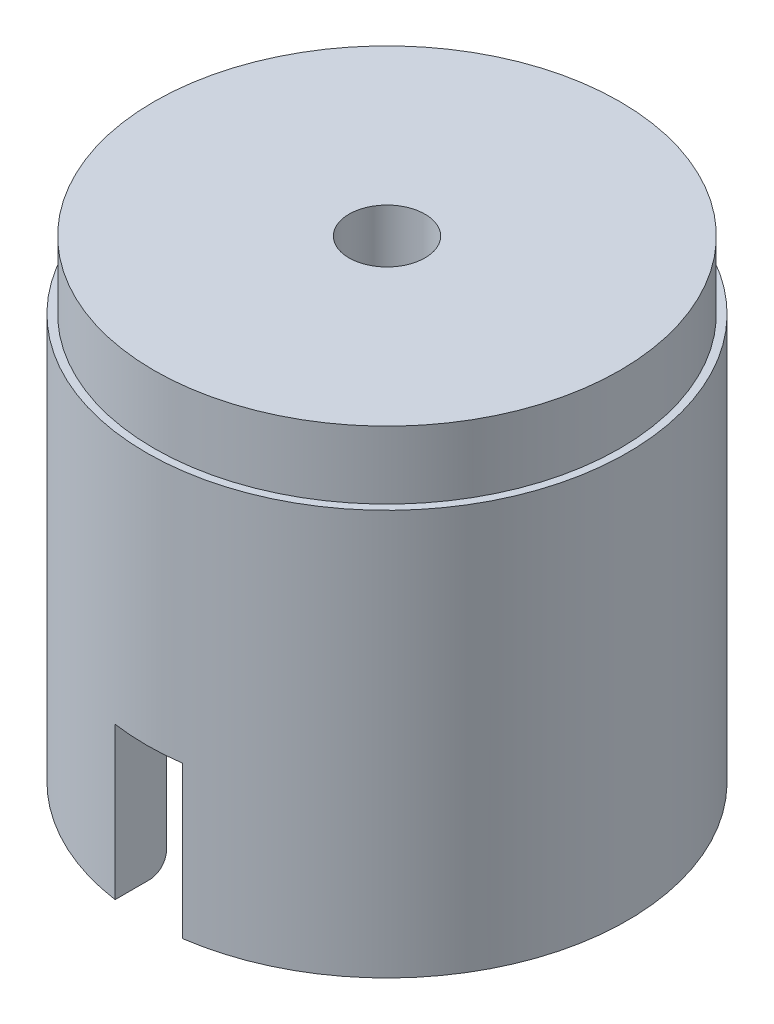
ISO-10303-21;
HEADER;
FILE_DESCRIPTION(('STEP AP214'),'2;1');
FILE_NAME('part.step','',(''),(''),'','','');
FILE_SCHEMA(('AUTOMOTIVE_DESIGN { 1 0 10303 214 1 1 1 1 }'));
ENDSEC;
DATA;
#1=APPLICATION_CONTEXT('core data for automotive mechanical design processes');
#2=APPLICATION_PROTOCOL_DEFINITION('international standard','automotive_design',2000,#1);
#3=PRODUCT_CONTEXT('',#1,'mechanical');
#4=PRODUCT('Part','Part','',(#3));
#5=PRODUCT_RELATED_PRODUCT_CATEGORY('part','',(#4));
#6=PRODUCT_DEFINITION_FORMATION('','',#4);
#7=PRODUCT_DEFINITION_CONTEXT('part definition',#1,'design');
#8=PRODUCT_DEFINITION('design','',#6,#7);
#9=PRODUCT_DEFINITION_SHAPE('','',#8);
#10=(LENGTH_UNIT() NAMED_UNIT(*) SI_UNIT(.MILLI.,.METRE.));
#11=(NAMED_UNIT(*) PLANE_ANGLE_UNIT() SI_UNIT($,.RADIAN.));
#12=(NAMED_UNIT(*) SI_UNIT($,.STERADIAN.) SOLID_ANGLE_UNIT());
#13=UNCERTAINTY_MEASURE_WITH_UNIT(LENGTH_MEASURE(1.E-05),#10,'distance_accuracy_value','');
#14=(GEOMETRIC_REPRESENTATION_CONTEXT(3) GLOBAL_UNCERTAINTY_ASSIGNED_CONTEXT((#13)) GLOBAL_UNIT_ASSIGNED_CONTEXT((#10,
#11,#12)) REPRESENTATION_CONTEXT('',''));
#15=CARTESIAN_POINT('',(0.,0.,0.));
#16=DIRECTION('',(0.,0.,1.));
#17=DIRECTION('',(1.,0.,0.));
#18=AXIS2_PLACEMENT_3D('',#15,#16,#17);
#19=CARTESIAN_POINT('',(0.,0.,0.));
#20=DIRECTION('',(0.,1.,0.));
#21=DIRECTION('',(0.,0.,1.));
#22=AXIS2_PLACEMENT_3D('',#19,#20,#21);
#23=PLANE('',#22);
#24=CARTESIAN_POINT('',(0.,0.,0.));
#25=DIRECTION('',(0.,1.,0.));
#26=DIRECTION('',(0.,0.,1.));
#27=AXIS2_PLACEMENT_3D('',#24,#25,#26);
#28=CIRCLE('',#27,14.25);
#29=CARTESIAN_POINT('',(-2.,0.,-14.1089510595225));
#30=VERTEX_POINT('',#29);
#31=CARTESIAN_POINT('',(-2.,0.,14.1089510595225));
#32=VERTEX_POINT('',#31);
#33=EDGE_CURVE('E198',#30,#32,#28,.T.);
#34=ORIENTED_EDGE('',*,*,#33,.F.);
#35=DIRECTION('',(0.,0.,-1.));
#36=VECTOR('',#35,1.);
#37=CARTESIAN_POINT('',(-2.,0.,14.25));
#38=LINE('',#37,#36);
#39=CARTESIAN_POINT('',(-2.,0.,-12.0856319652694));
#40=VERTEX_POINT('',#39);
#41=EDGE_CURVE('E270',#40,#30,#38,.T.);
#42=ORIENTED_EDGE('',*,*,#41,.F.);
#43=CARTESIAN_POINT('',(0.,0.,0.));
#44=DIRECTION('',(0.,1.,0.));
#45=DIRECTION('',(0.,0.,1.));
#46=AXIS2_PLACEMENT_3D('',#43,#44,#45);
#47=CIRCLE('',#46,12.25);
#48=CARTESIAN_POINT('',(-2.,0.,12.0856319652719));
#49=VERTEX_POINT('',#48);
#50=EDGE_CURVE('E193',#40,#49,#47,.T.);
#51=ORIENTED_EDGE('',*,*,#50,.T.);
#52=EDGE_CURVE('E272',#32,#49,#38,.T.);
#53=ORIENTED_EDGE('',*,*,#52,.F.);
#54=EDGE_LOOP('',(#34,#42,#51,#53));
#55=FACE_BOUND('',#54,.T.);
#56=ADVANCED_FACE('F46',(#55),#23,.F.);
#57=CARTESIAN_POINT('',(0.,1.,0.));
#58=DIRECTION('',(0.,1.,0.));
#59=DIRECTION('',(0.,0.,1.));
#60=AXIS2_PLACEMENT_3D('',#57,#58,#59);
#61=TOROIDAL_SURFACE('',#60,12.25,1.);
#62=CARTESIAN_POINT('',(-2.,0.0384396960274335,-11.8072161191829));
#63=CARTESIAN_POINT('',(-2.,0.022813902189131,-11.862722440152));
#64=CARTESIAN_POINT('',(-2.,0.0118654900201605,-11.9195905242867));
#65=CARTESIAN_POINT('',(-2.,-0.000348546361597228,-12.0344074015084));
#66=CARTESIAN_POINT('',(-2.,-0.0016018466109054,-12.0923574762567));
#67=CARTESIAN_POINT('',(-2.,0.00563845453101223,-12.2076291474685));
#68=CARTESIAN_POINT('',(-2.,0.014128171460806,-12.2649509852089));
#69=CARTESIAN_POINT('',(-2.,0.0406353575985942,-12.3773317849771));
#70=CARTESIAN_POINT('',(-2.,0.0586501707015698,-12.4323913732301));
#71=CARTESIAN_POINT('',(-2.,0.103671550715942,-12.5385297701235));
#72=CARTESIAN_POINT('',(-2.,0.13065368842611,-12.5896189336452));
#73=CARTESIAN_POINT('',(-2.,0.192896248662006,-12.6864827230442));
#74=CARTESIAN_POINT('',(-2.,0.228156655103102,-12.7322573592473));
#75=CARTESIAN_POINT('',(-2.,0.305583499600001,-12.8166911902762));
#76=CARTESIAN_POINT('',(-2.,0.34767709662368,-12.8554171694217));
#77=CARTESIAN_POINT('',(-2.,0.437836224537872,-12.9251487865481));
#78=CARTESIAN_POINT('',(-2.,0.485901337534769,-12.9561549643139));
#79=CARTESIAN_POINT('',(-2.,0.586019647163424,-13.0091776446524));
#80=CARTESIAN_POINT('',(-2.,0.63801819321998,-13.0312973534139));
#81=CARTESIAN_POINT('',(-2.,0.745012567448497,-13.0664003105432));
#82=CARTESIAN_POINT('',(-2.,0.800008217450895,-13.0793841013792));
#83=CARTESIAN_POINT('',(-2.,0.910890028622209,-13.095740844247));
#84=CARTESIAN_POINT('',(-2.,0.9667632726275,-13.0992014596816));
#85=CARTESIAN_POINT('',(-2.,1.07829311322068,-13.0966588680863));
#86=CARTESIAN_POINT('',(-2.,1.13394971572339,-13.090655921276));
#87=CARTESIAN_POINT('',(-2.,1.24327669025393,-13.0694041558035));
#88=CARTESIAN_POINT('',(-2.,1.29695299557747,-13.0541858269402));
#89=CARTESIAN_POINT('',(-2.,1.40100238285518,-13.0149856116269));
#90=CARTESIAN_POINT('',(-2.,1.45137543842847,-12.9910036551976));
#91=CARTESIAN_POINT('',(-2.,1.54759784221479,-12.934882419652));
#92=CARTESIAN_POINT('',(-2.,1.59342992901935,-12.9027135572724));
#93=CARTESIAN_POINT('',(-2.,1.67910629559831,-12.8312040702829));
#94=CARTESIAN_POINT('',(-2.,1.71895032566519,-12.7918631467426));
#95=CARTESIAN_POINT('',(-2.,1.79192692496902,-12.7067399127893));
#96=CARTESIAN_POINT('',(-2.,1.82499309922724,-12.6609006926318));
#97=CARTESIAN_POINT('',(-2.,1.88306622402572,-12.5643746505511));
#98=CARTESIAN_POINT('',(-2.,1.90807267951866,-12.513687531106));
#99=CARTESIAN_POINT('',(-2.,1.94962875096384,-12.4082601517914));
#100=CARTESIAN_POINT('',(-2.,1.96607434631554,-12.3534788867324));
#101=CARTESIAN_POINT('',(-2.,1.98963605794466,-12.2419452998302));
#102=CARTESIAN_POINT('',(-2.,1.99675160721992,-12.1851928584106));
#103=CARTESIAN_POINT('',(-2.,2.00150366086912,-12.0707266688981));
#104=CARTESIAN_POINT('',(-2.,1.99904538764813,-12.0130089702222));
#105=CARTESIAN_POINT('',(-2.,1.98451062797593,-11.8987960990058));
#106=CARTESIAN_POINT('',(-2.,1.97243381224492,-11.8423009683866));
#107=CARTESIAN_POINT('',(-2.,1.93892662494283,-11.73194007359));
#108=CARTESIAN_POINT('',(-2.,1.91746408482456,-11.6780840670108));
#109=CARTESIAN_POINT('',(-2.,1.86575328516538,-11.5747668186685));
#110=CARTESIAN_POINT('',(-2.,1.8355051580229,-11.5253055106921));
#111=CARTESIAN_POINT('',(-2.,1.76723661992728,-11.432498694411));
#112=CARTESIAN_POINT('',(-2.,1.72926067906094,-11.3891204909866));
#113=CARTESIAN_POINT('',(-2.,1.64647806085301,-11.3094601110091));
#114=CARTESIAN_POINT('',(-2.,1.60167186221755,-11.2731774375647));
#115=CARTESIAN_POINT('',(-2.,1.5071255629736,-11.2092588745965));
#116=CARTESIAN_POINT('',(-2.,1.45745818616432,-11.181515434431));
#117=CARTESIAN_POINT('',(-2.,1.35411958708503,-11.1349043382681));
#118=CARTESIAN_POINT('',(-2.,1.30044872004264,-11.1160358958795));
#119=CARTESIAN_POINT('',(-2.,1.19147340161584,-11.0879861075713));
#120=CARTESIAN_POINT('',(-2.,1.1362044493589,-11.0786667581658));
#121=CARTESIAN_POINT('',(-2.,1.02488765187091,-11.0695264471786));
#122=CARTESIAN_POINT('',(-2.,0.968839851735535,-11.0697049379391));
#123=CARTESIAN_POINT('',(-2.,0.858052287865155,-11.0795119543212));
#124=CARTESIAN_POINT('',(-2.,0.803305507255658,-11.089061494509));
#125=CARTESIAN_POINT('',(-2.,0.696188799226591,-11.117194457945));
#126=CARTESIAN_POINT('',(-2.,0.64381877542576,-11.1357775145113));
#127=CARTESIAN_POINT('',(-2.,0.542788548610156,-11.1814619825034));
#128=CARTESIAN_POINT('',(-2.,0.494137522362797,-11.208583670388));
#129=CARTESIAN_POINT('',(-2.,0.401995967697724,-11.2705272149602));
#130=CARTESIAN_POINT('',(-2.,0.358506999206741,-11.305351390212));
#131=CARTESIAN_POINT('',(-2.,0.277361685366345,-11.3821479417218));
#132=CARTESIAN_POINT('',(-2.,0.239783737590362,-11.4242030423531));
#133=CARTESIAN_POINT('',(-2.,0.172134618718201,-11.5139154882057));
#134=CARTESIAN_POINT('',(-2.,0.142055183021836,-11.5615665797085));
#135=CARTESIAN_POINT('',(-2.,0.0998326336670687,-11.6425314478517));
#136=CARTESIAN_POINT('',(-2.,0.0851837055283847,-11.6745656947791));
#137=CARTESIAN_POINT('',(-2.,0.0592556312645726,-11.7399695771181));
#138=CARTESIAN_POINT('',(-2.,0.047976509156312,-11.7733392220452));
#139=CARTESIAN_POINT('',(-2.,0.0384396960274335,-11.8072161191829));
#140=B_SPLINE_CURVE_WITH_KNOTS('',3,(#62,#63,#64,#65,#66,#67,#68,#69,#70,#71,#72,#73,#74,#75,
#76,#77,#78,#79,#80,#81,#82,#83,#84,#85,#86,#87,#88,#89,#90,#91,#92,#93,#94,#95,#96,#97,#98,#99,
#100,#101,#102,#103,#104,#105,#106,#107,#108,#109,#110,#111,#112,#113,#114,#115,#116,#117,#118,
#119,#120,#121,#122,#123,#124,#125,#126,#127,#128,#129,#130,#131,#132,#133,#134,#135,#136,#137,
#138,#139),.UNSPECIFIED.,.T.,.F.,(4,2,2,2,2,2,2,2,2,2,2,2,2,2,2,2,2,2,2,2,2,2,2,2,2,2,2,2,2,2,2,
2,2,2,2,2,2,2,4),(0.,0.172863079628368,0.34594585850197,0.518959654650472,0.691925230746272,
0.864423416560157,1.03692126721373,1.20768836840343,1.37844352583767,1.54715386679004,
1.71585418929524,1.88299630091201,2.05013381670067,2.21672134378787,2.38331020113786,
2.55050979045926,2.7177163502251,2.88648986880407,3.05527375188384,3.2260632364578,
3.39686309970715,3.56935810104716,3.74185900780981,3.91495583399177,4.08805005174747,
4.2601750119623,4.43228791415187,4.6021348572586,4.77196674781891,4.93930805174438,
5.1066397065651,5.27257298797644,5.43849953450657,5.6048231127625,5.77119682521145,
5.93961878685994,6.1078542906895,6.21335620344265,6.31885886809814),.UNSPECIFIED.);
#141=CARTESIAN_POINT('',(-2.,0.999999999999951,-11.0707949127414));
#142=VERTEX_POINT('',#141);
#143=EDGE_CURVE('E242',#142,#40,#140,.T.);
#144=ORIENTED_EDGE('',*,*,#143,.F.);
#145=CARTESIAN_POINT('',(0.,1.,0.));
#146=DIRECTION('',(0.,1.,0.));
#147=DIRECTION('',(0.,0.,1.));
#148=AXIS2_PLACEMENT_3D('',#145,#146,#147);
#149=CIRCLE('',#148,11.25);
#150=CARTESIAN_POINT('',(-2.,1.,11.0707949127423));
#151=VERTEX_POINT('',#150);
#152=EDGE_CURVE('E209',#151,#142,#149,.F.);
#153=ORIENTED_EDGE('',*,*,#152,.F.);
#154=CARTESIAN_POINT('',(-2.,0.390919972436644,11.2809732147051));
#155=CARTESIAN_POINT('',(-2.,0.434882943124424,11.2466876205336));
#156=CARTESIAN_POINT('',(-2.,0.481740871031031,11.2160540659421));
#157=CARTESIAN_POINT('',(-2.,0.579960841677936,11.163041962462));
#158=CARTESIAN_POINT('',(-2.,0.631327446024756,11.1406718960415));
#159=CARTESIAN_POINT('',(-2.,0.737103729610829,11.1049048777515));
#160=CARTESIAN_POINT('',(-2.,0.791513469468614,11.0915081046969));
#161=CARTESIAN_POINT('',(-2.,0.901802836525828,11.0741177893587));
#162=CARTESIAN_POINT('',(-2.,0.957682108760408,11.070121996989));
#163=CARTESIAN_POINT('',(-2.,1.06891929819895,11.0716475704558));
#164=CARTESIAN_POINT('',(-2.,1.12427813336345,11.0771027511032));
#165=CARTESIAN_POINT('',(-2.,1.23329339937328,11.0972318713758));
#166=CARTESIAN_POINT('',(-2.,1.28694979516278,11.111906000704));
#167=CARTESIAN_POINT('',(-2.,1.39105153181071,11.1500182884643));
#168=CARTESIAN_POINT('',(-2.,1.44149684272037,11.1734565286225));
#169=CARTESIAN_POINT('',(-2.,1.53779090550631,11.2283868952942));
#170=CARTESIAN_POINT('',(-2.,1.58363946434882,11.2598793598359));
#171=CARTESIAN_POINT('',(-2.,1.66995235182457,11.3303513219558));
#172=CARTESIAN_POINT('',(-2.,1.71035692113673,11.369403986697));
#173=CARTESIAN_POINT('',(-2.,1.78415374738297,11.4536503407389));
#174=CARTESIAN_POINT('',(-2.,1.81754548141693,11.4988444875553));
#175=CARTESIAN_POINT('',(-2.,1.87689108238969,11.5948097539462));
#176=CARTESIAN_POINT('',(-2.,1.90272725171623,11.6456536657768));
#177=CARTESIAN_POINT('',(-2.,1.94561480866541,11.7509207837691));
#178=CARTESIAN_POINT('',(-2.,1.96266556240909,11.8053442478807));
#179=CARTESIAN_POINT('',(-2.,1.98768943186735,11.9169339101957));
#180=CARTESIAN_POINT('',(-2.,1.99555017335821,11.9741253331105));
#181=CARTESIAN_POINT('',(-2.,2.00160356938687,12.0890187981362));
#182=CARTESIAN_POINT('',(-2.,1.99979588591257,12.1467208580288));
#183=CARTESIAN_POINT('',(-2.,1.98651962359917,12.2612499884865));
#184=CARTESIAN_POINT('',(-2.,1.97501065084057,12.3180723873561));
#185=CARTESIAN_POINT('',(-2.,1.94257204562466,12.4289631960179));
#186=CARTESIAN_POINT('',(-2.,1.92164254102995,12.4830316431778));
#187=CARTESIAN_POINT('',(-2.,1.87103803945419,12.5865962140788));
#188=CARTESIAN_POINT('',(-2.,1.84140447204229,12.6361125712809));
#189=CARTESIAN_POINT('',(-2.,1.77416032051466,12.729396840048));
#190=CARTESIAN_POINT('',(-2.,1.73655015932882,12.7731650561881));
#191=CARTESIAN_POINT('',(-2.,1.65484382295542,12.8532060324949));
#192=CARTESIAN_POINT('',(-2.,1.61082102245505,12.8895536845069));
#193=CARTESIAN_POINT('',(-2.,1.51723656280703,12.9542364403262));
#194=CARTESIAN_POINT('',(-2.,1.46767527512708,12.9825720810517));
#195=CARTESIAN_POINT('',(-2.,1.36505257137606,13.0300782853836));
#196=CARTESIAN_POINT('',(-2.,1.31203951817372,13.0493533432161));
#197=CARTESIAN_POINT('',(-2.,1.20351456141238,13.0786438626554));
#198=CARTESIAN_POINT('',(-2.,1.14800279367815,13.0886598269309));
#199=CARTESIAN_POINT('',(-2.,1.03656003607106,13.0990810115269));
#200=CARTESIAN_POINT('',(-2.,0.980636572528016,13.0995668680515));
#201=CARTESIAN_POINT('',(-2.,0.869506651740311,13.0911195841545));
#202=CARTESIAN_POINT('',(-2.,0.814300178335945,13.0821866563899));
#203=CARTESIAN_POINT('',(-2.,0.706294119139579,13.0552024254409));
#204=CARTESIAN_POINT('',(-2.,0.653489490330426,13.0371712896774));
#205=CARTESIAN_POINT('',(-2.,0.5516368281464,12.9925400023365));
#206=CARTESIAN_POINT('',(-2.,0.50258884400192,12.9659397384856));
#207=CARTESIAN_POINT('',(-2.,0.409383287828495,12.9048094247795));
#208=CARTESIAN_POINT('',(-2.,0.365249771018571,12.8702427114561));
#209=CARTESIAN_POINT('',(-2.,0.283340637895985,12.7942576630241));
#210=CARTESIAN_POINT('',(-2.,0.245565323673572,12.7528390025518));
#211=CARTESIAN_POINT('',(-2.,0.177033823884762,12.6638883422609));
#212=CARTESIAN_POINT('',(-2.,0.146351738566173,12.6162992615919));
#213=CARTESIAN_POINT('',(-2.,0.0933035316358617,12.5166929573697));
#214=CARTESIAN_POINT('',(-2.,0.0709379490016502,12.4646754470863));
#215=CARTESIAN_POINT('',(-2.,0.0348812262919231,12.3570257894314));
#216=CARTESIAN_POINT('',(-2.,0.0212965588721425,12.3013579735348));
#217=CARTESIAN_POINT('',(-2.,0.00357200605409817,12.1885402419282));
#218=CARTESIAN_POINT('',(-2.,-0.000567688518077913,12.1313902962968));
#219=CARTESIAN_POINT('',(-2.,0.000698574590184633,12.0166756706955));
#220=CARTESIAN_POINT('',(-2.,0.00619157147220117,11.9591119382596));
#221=CARTESIAN_POINT('',(-2.,0.0267429987620017,11.8457005108747));
#222=CARTESIAN_POINT('',(-2.,0.0418040266373357,11.7898532862297));
#223=CARTESIAN_POINT('',(-2.,0.0811381530890731,11.6813416090988));
#224=CARTESIAN_POINT('',(-2.,0.10543508134787,11.6286858017851));
#225=CARTESIAN_POINT('',(-2.,0.162570626025205,11.5282872152226));
#226=CARTESIAN_POINT('',(-2.,0.195398857539102,11.4805385605752));
#227=CARTESIAN_POINT('',(-2.,0.255556178195513,11.4073036709754));
#228=CARTESIAN_POINT('',(-2.,0.280659244297273,11.3799587621212));
#229=CARTESIAN_POINT('',(-2.,0.333721342942103,11.3281951532562));
#230=CARTESIAN_POINT('',(-2.,0.361680360953742,11.3037764383579));
#231=CARTESIAN_POINT('',(-2.,0.390919972436644,11.2809732147051));
#232=B_SPLINE_CURVE_WITH_KNOTS('',3,(#154,#155,#156,#157,#158,#159,#160,#161,#162,#163,#164,
#165,#166,#167,#168,#169,#170,#171,#172,#173,#174,#175,#176,#177,#178,#179,#180,#181,#182,#183,
#184,#185,#186,#187,#188,#189,#190,#191,#192,#193,#194,#195,#196,#197,#198,#199,#200,#201,#202,
#203,#204,#205,#206,#207,#208,#209,#210,#211,#212,#213,#214,#215,#216,#217,#218,#219,#220,#221,
#222,#223,#224,#225,#226,#227,#228,#229,#230,#231),.UNSPECIFIED.,.T.,.F.,(4,2,2,2,2,2,2,2,2,2,2,
2,2,2,2,2,2,2,2,2,2,2,2,2,2,2,2,2,2,2,2,2,2,2,2,2,2,2,4),(0.,0.167121841592569,
0.334414760107892,0.501711012245912,0.668967218641445,0.83505685881249,1.00114991680662,
1.1672445236706,1.33334610251146,1.50114375951076,1.66895392361805,1.83925371265245,
2.00956578731443,2.1819393272487,2.3543188934718,2.52741977404516,2.7005183052328,
2.87280591721303,3.04508439655172,3.21552733467133,3.38595884799454,3.55437341605811,
3.72277884049576,3.88975873151659,4.05673485254824,4.22334246356481,4.3899522575814,
4.55734470703537,4.72474510737809,4.89382234138746,5.06291053107785,5.23401233208774,
5.4051175900052,5.57777689940711,5.75048310128999,5.92363796322886,6.09658302816011,
6.20773572108365,6.3188878484769),.UNSPECIFIED.);
#233=EDGE_CURVE('E238',#49,#151,#232,.T.);
#234=ORIENTED_EDGE('',*,*,#233,.F.);
#235=ORIENTED_EDGE('',*,*,#50,.F.);
#236=EDGE_LOOP('',(#144,#153,#234,#235));
#237=FACE_BOUND('',#236,.T.);
#238=ADVANCED_FACE('F294',(#237),#61,.T.);
#239=CARTESIAN_POINT('',(0.,24.,0.));
#240=DIRECTION('',(0.,1.,0.));
#241=DIRECTION('',(0.,0.,1.));
#242=AXIS2_PLACEMENT_3D('',#239,#240,#241);
#243=PLANE('',#242);
#244=CARTESIAN_POINT('',(0.,24.,0.));
#245=DIRECTION('',(0.,1.,0.));
#246=DIRECTION('',(0.,0.,1.));
#247=AXIS2_PLACEMENT_3D('',#244,#245,#246);
#248=CIRCLE('',#247,13.8);
#249=CARTESIAN_POINT('',(0.,24.,13.8));
#250=VERTEX_POINT('',#249);
#251=EDGE_CURVE('E189',#250,#250,#248,.T.);
#252=ORIENTED_EDGE('',*,*,#251,.F.);
#253=EDGE_LOOP('',(#252));
#254=FACE_BOUND('',#253,.T.);
#255=CARTESIAN_POINT('',(0.,24.,0.));
#256=DIRECTION('',(0.,1.,0.));
#257=DIRECTION('',(0.,0.,1.));
#258=AXIS2_PLACEMENT_3D('',#255,#256,#257);
#259=CIRCLE('',#258,14.25);
#260=CARTESIAN_POINT('',(0.,24.,14.25));
#261=VERTEX_POINT('',#260);
#262=EDGE_CURVE('E194',#261,#261,#259,.T.);
#263=ORIENTED_EDGE('',*,*,#262,.T.);
#264=EDGE_LOOP('',(#263));
#265=FACE_BOUND('',#264,.T.);
#266=ADVANCED_FACE('F296',(#254,#265),#243,.T.);
#267=CARTESIAN_POINT('',(1.99999999999999,0.,14.1089510595225));
#268=VERTEX_POINT('',#267);
#269=CARTESIAN_POINT('',(2.,0.,-14.1089510595225));
#270=VERTEX_POINT('',#269);
#271=EDGE_CURVE('E152',#268,#270,#28,.T.);
#272=ORIENTED_EDGE('',*,*,#271,.F.);
#273=DIRECTION('',(0.,0.,1.));
#274=VECTOR('',#273,1.);
#275=CARTESIAN_POINT('',(1.99999999999999,0.,14.25));
#276=LINE('',#275,#274);
#277=CARTESIAN_POINT('',(2.,0.,12.085631965271));
#278=VERTEX_POINT('',#277);
#279=EDGE_CURVE('E274',#278,#268,#276,.T.);
#280=ORIENTED_EDGE('',*,*,#279,.F.);
#281=CARTESIAN_POINT('',(2.,0.,-12.0856319652718));
#282=VERTEX_POINT('',#281);
#283=EDGE_CURVE('E204',#278,#282,#47,.T.);
#284=ORIENTED_EDGE('',*,*,#283,.T.);
#285=EDGE_CURVE('E63',#270,#282,#276,.T.);
#286=ORIENTED_EDGE('',*,*,#285,.F.);
#287=EDGE_LOOP('',(#272,#280,#284,#286));
#288=FACE_BOUND('',#287,.T.);
#289=ADVANCED_FACE('F301',(#288),#23,.F.);
#290=CARTESIAN_POINT('',(0.,24.,0.));
#291=DIRECTION('',(0.,-1.,0.));
#292=DIRECTION('',(0.,0.,-1.));
#293=AXIS2_PLACEMENT_3D('',#290,#291,#292);
#294=CYLINDRICAL_SURFACE('',#293,14.25);
#295=ORIENTED_EDGE('',*,*,#262,.F.);
#296=EDGE_LOOP('',(#295));
#297=FACE_BOUND('',#296,.T.);
#298=ORIENTED_EDGE('',*,*,#33,.T.);
#299=DIRECTION('',(0.,-1.,0.));
#300=VECTOR('',#299,1.);
#301=CARTESIAN_POINT('',(-2.,24.,14.1089510595225));
#302=LINE('',#301,#300);
#303=CARTESIAN_POINT('',(-2.,9.,14.1089510595225));
#304=VERTEX_POINT('',#303);
#305=EDGE_CURVE('E168',#32,#304,#302,.F.);
#306=ORIENTED_EDGE('',*,*,#305,.T.);
#307=CARTESIAN_POINT('',(0.,9.,0.));
#308=DIRECTION('',(0.,1.,0.));
#309=DIRECTION('',(0.,0.,1.));
#310=AXIS2_PLACEMENT_3D('',#307,#308,#309);
#311=CIRCLE('',#310,14.25);
#312=CARTESIAN_POINT('',(1.99999999999999,9.,14.1089510595225));
#313=VERTEX_POINT('',#312);
#314=EDGE_CURVE('E138',#304,#313,#311,.T.);
#315=ORIENTED_EDGE('',*,*,#314,.T.);
#316=DIRECTION('',(0.,-1.,0.));
#317=VECTOR('',#316,1.);
#318=CARTESIAN_POINT('',(1.99999999999999,24.,14.1089510595225));
#319=LINE('',#318,#317);
#320=EDGE_CURVE('E154',#313,#268,#319,.T.);
#321=ORIENTED_EDGE('',*,*,#320,.T.);
#322=ORIENTED_EDGE('',*,*,#271,.T.);
#323=DIRECTION('',(0.,-1.,0.));
#324=VECTOR('',#323,1.);
#325=CARTESIAN_POINT('',(2.,24.,-14.1089510595225));
#326=LINE('',#325,#324);
#327=CARTESIAN_POINT('',(2.,9.,-14.1089510595225));
#328=VERTEX_POINT('',#327);
#329=EDGE_CURVE('E141',#270,#328,#326,.F.);
#330=ORIENTED_EDGE('',*,*,#329,.T.);
#331=CARTESIAN_POINT('',(-2.,9.,-14.1089510595225));
#332=VERTEX_POINT('',#331);
#333=EDGE_CURVE('E126',#328,#332,#311,.T.);
#334=ORIENTED_EDGE('',*,*,#333,.T.);
#335=DIRECTION('',(0.,-1.,0.));
#336=VECTOR('',#335,1.);
#337=CARTESIAN_POINT('',(-2.,24.,-14.1089510595225));
#338=LINE('',#337,#336);
#339=EDGE_CURVE('E172',#332,#30,#338,.T.);
#340=ORIENTED_EDGE('',*,*,#339,.T.);
#341=EDGE_LOOP('',(#298,#306,#315,#321,#322,#330,#334,#340));
#342=FACE_BOUND('',#341,.T.);
#343=ADVANCED_FACE('F149',(#297,#342),#294,.T.);
#344=CARTESIAN_POINT('',(0.,24.,0.));
#345=DIRECTION('',(0.,-1.,0.));
#346=DIRECTION('',(0.,0.,-1.));
#347=AXIS2_PLACEMENT_3D('',#344,#345,#346);
#348=CYLINDRICAL_SURFACE('',#347,11.25);
#349=DIRECTION('',(0.,-1.,0.));
#350=VECTOR('',#349,1.);
#351=CARTESIAN_POINT('',(-2.,24.,11.0707949127423));
#352=LINE('',#351,#350);
#353=CARTESIAN_POINT('',(-2.,9.,11.0707949127423));
#354=VERTEX_POINT('',#353);
#355=EDGE_CURVE('E158',#151,#354,#352,.F.);
#356=ORIENTED_EDGE('',*,*,#355,.F.);
#357=ORIENTED_EDGE('',*,*,#152,.T.);
#358=DIRECTION('',(0.,-1.,0.));
#359=VECTOR('',#358,1.);
#360=CARTESIAN_POINT('',(-2.,24.,-11.0707949127423));
#361=LINE('',#360,#359);
#362=CARTESIAN_POINT('',(-2.,9.,-11.0707949127423));
#363=VERTEX_POINT('',#362);
#364=EDGE_CURVE('E165',#363,#142,#361,.T.);
#365=ORIENTED_EDGE('',*,*,#364,.F.);
#366=CARTESIAN_POINT('',(0.,9.,0.));
#367=DIRECTION('',(0.,1.,0.));
#368=DIRECTION('',(0.,0.,1.));
#369=AXIS2_PLACEMENT_3D('',#366,#367,#368);
#370=CIRCLE('',#369,11.25);
#371=CARTESIAN_POINT('',(2.,9.,-11.0707949127423));
#372=VERTEX_POINT('',#371);
#373=EDGE_CURVE('E51',#372,#363,#370,.T.);
#374=ORIENTED_EDGE('',*,*,#373,.F.);
#375=DIRECTION('',(0.,-1.,0.));
#376=VECTOR('',#375,1.);
#377=CARTESIAN_POINT('',(2.,24.,-11.0707949127423));
#378=LINE('',#377,#376);
#379=CARTESIAN_POINT('',(2.,1.,-11.0707949127422));
#380=VERTEX_POINT('',#379);
#381=EDGE_CURVE('E143',#380,#372,#378,.F.);
#382=ORIENTED_EDGE('',*,*,#381,.F.);
#383=CARTESIAN_POINT('',(2.,1.,11.0707949127423));
#384=VERTEX_POINT('',#383);
#385=EDGE_CURVE('E208',#380,#384,#149,.F.);
#386=ORIENTED_EDGE('',*,*,#385,.T.);
#387=DIRECTION('',(0.,-1.,0.));
#388=VECTOR('',#387,1.);
#389=CARTESIAN_POINT('',(2.,24.,11.0707949127423));
#390=LINE('',#389,#388);
#391=CARTESIAN_POINT('',(2.,9.,11.0707949127423));
#392=VERTEX_POINT('',#391);
#393=EDGE_CURVE('E71',#392,#384,#390,.T.);
#394=ORIENTED_EDGE('',*,*,#393,.F.);
#395=EDGE_CURVE('E13',#354,#392,#370,.T.);
#396=ORIENTED_EDGE('',*,*,#395,.F.);
#397=EDGE_LOOP('',(#356,#357,#365,#374,#382,#386,#394,#396));
#398=FACE_BOUND('',#397,.T.);
#399=CARTESIAN_POINT('',(0.,24.,0.));
#400=DIRECTION('',(0.,1.,0.));
#401=DIRECTION('',(0.,0.,1.));
#402=AXIS2_PLACEMENT_3D('',#399,#400,#401);
#403=CIRCLE('',#402,11.25);
#404=CARTESIAN_POINT('',(0.,24.,11.25));
#405=VERTEX_POINT('',#404);
#406=EDGE_CURVE('E188',#405,#405,#403,.T.);
#407=ORIENTED_EDGE('',*,*,#406,.T.);
#408=EDGE_LOOP('',(#407));
#409=FACE_BOUND('',#408,.T.);
#410=ADVANCED_FACE('F260',(#398,#409),#348,.F.);
#411=CARTESIAN_POINT('',(0.,28.,0.));
#412=DIRECTION('',(0.,1.,0.));
#413=DIRECTION('',(0.,0.,1.));
#414=AXIS2_PLACEMENT_3D('',#411,#412,#413);
#415=PLANE('',#414);
#416=CARTESIAN_POINT('',(0.,28.,0.));
#417=DIRECTION('',(0.,1.,0.));
#418=DIRECTION('',(0.,0.,1.));
#419=AXIS2_PLACEMENT_3D('',#416,#417,#418);
#420=CIRCLE('',#419,13.8);
#421=CARTESIAN_POINT('',(0.,28.,13.8));
#422=VERTEX_POINT('',#421);
#423=EDGE_CURVE('E181',#422,#422,#420,.T.);
#424=ORIENTED_EDGE('',*,*,#423,.T.);
#425=EDGE_LOOP('',(#424));
#426=FACE_BOUND('',#425,.T.);
#427=CARTESIAN_POINT('',(0.,28.,0.));
#428=DIRECTION('',(0.,1.,0.));
#429=DIRECTION('',(0.,0.,1.));
#430=AXIS2_PLACEMENT_3D('',#427,#428,#429);
#431=CIRCLE('',#430,2.25);
#432=CARTESIAN_POINT('',(0.,28.,2.25));
#433=VERTEX_POINT('',#432);
#434=EDGE_CURVE('E177',#433,#433,#431,.T.);
#435=ORIENTED_EDGE('',*,*,#434,.F.);
#436=EDGE_LOOP('',(#435));
#437=FACE_BOUND('',#436,.T.);
#438=ADVANCED_FACE('F320',(#426,#437),#415,.T.);
#439=CARTESIAN_POINT('',(0.,24.,0.));
#440=DIRECTION('',(0.,1.,0.));
#441=DIRECTION('',(0.,0.,1.));
#442=AXIS2_PLACEMENT_3D('',#439,#440,#441);
#443=PLANE('',#442);
#444=ORIENTED_EDGE('',*,*,#406,.F.);
#445=EDGE_LOOP('',(#444));
#446=FACE_BOUND('',#445,.T.);
#447=CARTESIAN_POINT('',(0.,24.,0.));
#448=DIRECTION('',(0.,1.,0.));
#449=DIRECTION('',(0.,0.,1.));
#450=AXIS2_PLACEMENT_3D('',#447,#448,#449);
#451=CIRCLE('',#450,2.25);
#452=CARTESIAN_POINT('',(0.,24.,2.25));
#453=VERTEX_POINT('',#452);
#454=EDGE_CURVE('E137',#453,#453,#451,.T.);
#455=ORIENTED_EDGE('',*,*,#454,.T.);
#456=EDGE_LOOP('',(#455));
#457=FACE_BOUND('',#456,.T.);
#458=ADVANCED_FACE('F315',(#446,#457),#443,.F.);
#459=CARTESIAN_POINT('',(0.,28.,0.));
#460=DIRECTION('',(0.,-1.,0.));
#461=DIRECTION('',(0.,0.,-1.));
#462=AXIS2_PLACEMENT_3D('',#459,#460,#461);
#463=CYLINDRICAL_SURFACE('',#462,13.8);
#464=ORIENTED_EDGE('',*,*,#423,.F.);
#465=EDGE_LOOP('',(#464));
#466=FACE_BOUND('',#465,.T.);
#467=ORIENTED_EDGE('',*,*,#251,.T.);
#468=EDGE_LOOP('',(#467));
#469=FACE_BOUND('',#468,.T.);
#470=ADVANCED_FACE('F310',(#466,#469),#463,.T.);
#471=CARTESIAN_POINT('',(0.,28.,0.));
#472=DIRECTION('',(0.,-1.,0.));
#473=DIRECTION('',(0.,0.,-1.));
#474=AXIS2_PLACEMENT_3D('',#471,#472,#473);
#475=CYLINDRICAL_SURFACE('',#474,2.25);
#476=ORIENTED_EDGE('',*,*,#434,.T.);
#477=EDGE_LOOP('',(#476));
#478=FACE_BOUND('',#477,.T.);
#479=ORIENTED_EDGE('',*,*,#454,.F.);
#480=EDGE_LOOP('',(#479));
#481=FACE_BOUND('',#480,.T.);
#482=ADVANCED_FACE('F306',(#478,#481),#475,.F.);
#483=CARTESIAN_POINT('',(2.,0.0384396960274336,-11.8072161191829));
#484=CARTESIAN_POINT('',(2.,0.0539481875948429,-11.7521442322867));
#485=CARTESIAN_POINT('',(2.,0.0740833864569553,-11.6983336112055));
#486=CARTESIAN_POINT('',(2.,0.123089688049788,-11.5947941697247));
#487=CARTESIAN_POINT('',(2.,0.151970758121899,-11.5450700892416));
#488=CARTESIAN_POINT('',(2.,0.217697135665195,-11.4511847878859));
#489=CARTESIAN_POINT('',(2.,0.254542663074818,-11.4070237206892));
#490=CARTESIAN_POINT('',(2.,0.335182354029824,-11.3256005340119));
#491=CARTESIAN_POINT('',(2.,0.378974583084503,-11.2883365001133));
#492=CARTESIAN_POINT('',(2.,0.471840370914647,-11.222156288247));
#493=CARTESIAN_POINT('',(2.,0.520859624311873,-11.1931639432415));
#494=CARTESIAN_POINT('',(2.,0.623126824897539,-11.1439629829402));
#495=CARTESIAN_POINT('',(2.,0.676374570397591,-11.1237539489999));
#496=CARTESIAN_POINT('',(2.,0.784736982053376,-11.0929970149574));
#497=CARTESIAN_POINT('',(2.,0.839812297400759,-11.0823104066767));
#498=CARTESIAN_POINT('',(2.,0.950976160989763,-11.0704294095667));
#499=CARTESIAN_POINT('',(2.,1.00706464120531,-11.0692343858088));
#500=CARTESIAN_POINT('',(2.,1.11812445564135,-11.076340772705));
#501=CARTESIAN_POINT('',(2.,1.17310130563899,-11.0845563947689));
#502=CARTESIAN_POINT('',(2.,1.28089793710703,-11.1100868719733));
#503=CARTESIAN_POINT('',(2.,1.33371773190146,-11.1274016708995));
#504=CARTESIAN_POINT('',(2.,1.4358129124074,-11.1706342933417));
#505=CARTESIAN_POINT('',(2.,1.48508215948813,-11.1965666012854));
#506=CARTESIAN_POINT('',(2.,1.57863318175818,-11.2562461652079));
#507=CARTESIAN_POINT('',(2.,1.62291469845672,-11.2899938259433));
#508=CARTESIAN_POINT('',(2.,1.70578092663596,-11.3647419417406));
#509=CARTESIAN_POINT('',(2.,1.74429535816612,-11.4058202879778));
#510=CARTESIAN_POINT('',(2.,1.81400381236772,-11.4937774406685));
#511=CARTESIAN_POINT('',(2.,1.84519726933473,-11.540656694941));
#512=CARTESIAN_POINT('',(2.,1.89986356118876,-11.6396342110872));
#513=CARTESIAN_POINT('',(2.,1.92321459124455,-11.6917997588136));
#514=CARTESIAN_POINT('',(2.,1.96093829708341,-11.7992824055691));
#515=CARTESIAN_POINT('',(2.,1.97531036481551,-11.8545997177573));
#516=CARTESIAN_POINT('',(2.,1.99480806793523,-11.9674791431578));
#517=CARTESIAN_POINT('',(2.,1.99982865389677,-12.0250594261317));
#518=CARTESIAN_POINT('',(2.,2.00016271697828,-12.1402495132431));
#519=CARTESIAN_POINT('',(2.,1.99547591963498,-12.1978593181693));
#520=CARTESIAN_POINT('',(2.,1.97647885367098,-12.3116395743145));
#521=CARTESIAN_POINT('',(2.,1.9621414564158,-12.3678055033239));
#522=CARTESIAN_POINT('',(2.,1.92418620324363,-12.476910741927));
#523=CARTESIAN_POINT('',(2.,1.90056853830739,-12.5298501178947));
#524=CARTESIAN_POINT('',(2.,1.84484921986637,-12.63065726069));
#525=CARTESIAN_POINT('',(2.,1.81279776873467,-12.6785527641066));
#526=CARTESIAN_POINT('',(2.,1.74102424654187,-12.7682045678953));
#527=CARTESIAN_POINT('',(2.,1.70130261259556,-12.8099612178747));
#528=CARTESIAN_POINT('',(2.,1.61578692418827,-12.8856484111681));
#529=CARTESIAN_POINT('',(2.,1.57006549637934,-12.9196610053242));
#530=CARTESIAN_POINT('',(2.,1.47350661480114,-12.9794208820597));
#531=CARTESIAN_POINT('',(2.,1.42266950071052,-13.0051687129396));
#532=CARTESIAN_POINT('',(2.,1.31795750945509,-13.0473618259882));
#533=CARTESIAN_POINT('',(2.,1.26412468343187,-13.0639114962144));
#534=CARTESIAN_POINT('',(2.,1.15443494335746,-13.0876596983521));
#535=CARTESIAN_POINT('',(2.,1.09857813346035,-13.0948587107473));
#536=CARTESIAN_POINT('',(2.,0.98688418694371,-13.0996671689897));
#537=CARTESIAN_POINT('',(2.,0.931050184946799,-13.0973497378895));
#538=CARTESIAN_POINT('',(2.,0.820567568984452,-13.0833611232171));
#539=CARTESIAN_POINT('',(2.,0.765918936075609,-13.0716900892382));
#540=CARTESIAN_POINT('',(2.,0.659418194670594,-13.0393654665092));
#541=CARTESIAN_POINT('',(2.,0.607562884743013,-13.0187224178642));
#542=CARTESIAN_POINT('',(2.,0.508026901878415,-12.9690706053279));
#543=CARTESIAN_POINT('',(2.,0.460346320472484,-12.9400616580738));
#544=CARTESIAN_POINT('',(2.,0.37021330196265,-12.8743421767395));
#545=CARTESIAN_POINT('',(2.,0.327791954008152,-12.8375890188675));
#546=CARTESIAN_POINT('',(2.,0.249644199849152,-12.7575508017574));
#547=CARTESIAN_POINT('',(2.,0.213917860874399,-12.7142656769347));
#548=CARTESIAN_POINT('',(2.,0.149767449041686,-12.6219126619379));
#549=CARTESIAN_POINT('',(2.,0.121423571991021,-12.5727890773639));
#550=CARTESIAN_POINT('',(2.,0.0732679045074848,-12.4705088987976));
#551=CARTESIAN_POINT('',(2.,0.0534587344460199,-12.4173510720739));
#552=CARTESIAN_POINT('',(2.,0.0226977218738381,-12.307832237178));
#553=CARTESIAN_POINT('',(2.,0.011857456731852,-12.2514399461835));
#554=CARTESIAN_POINT('',(2.,-0.000271813417917348,-12.1376828673606));
#555=CARTESIAN_POINT('',(2.,-0.00157144697404995,-12.0803192330948));
#556=CARTESIAN_POINT('',(2.,0.0041128224916439,-11.9867486681238));
#557=CARTESIAN_POINT('',(2.,0.008287341745023,-11.9503480006688));
#558=CARTESIAN_POINT('',(2.,0.0204898918612504,-11.8781981820887));
#559=CARTESIAN_POINT('',(2.,0.0285179480629874,-11.8424490352492));
#560=CARTESIAN_POINT('',(2.,0.0384396960274336,-11.8072161191829));
#561=B_SPLINE_CURVE_WITH_KNOTS('',3,(#483,#484,#485,#486,#487,#488,#489,#490,#491,#492,#493,
#494,#495,#496,#497,#498,#499,#500,#501,#502,#503,#504,#505,#506,#507,#508,#509,#510,#511,#512,
#513,#514,#515,#516,#517,#518,#519,#520,#521,#522,#523,#524,#525,#526,#527,#528,#529,#530,#531,
#532,#533,#534,#535,#536,#537,#538,#539,#540,#541,#542,#543,#544,#545,#546,#547,#548,#549,#550,
#551,#552,#553,#554,#555,#556,#557,#558,#559,#560),.UNSPECIFIED.,.T.,.F.,(4,2,2,2,2,2,2,2,2,2,2,
2,2,2,2,2,2,2,2,2,2,2,2,2,2,2,2,2,2,2,2,2,2,2,2,2,2,2,4),(0.,0.17150973211491,0.343215667791477,
0.51492634573226,0.686589290019303,0.856616369069497,1.02663534312307,1.19413522257897,
1.36162389722839,1.52759779399467,1.69357066539256,1.85982392933357,2.02608580544466,
2.19423268856877,2.36239256042003,2.53305494852336,2.70372889254819,2.87630879339481,
3.04889357377368,3.22196554166815,3.39503394806142,3.56709459104007,3.7391454313753,
3.90927837785053,4.07940003503986,4.2475493925503,4.41569010936014,4.58254128288256,
4.74938978798575,4.91604281108791,5.08269948714961,5.25029858402712,5.41789936380628,
5.58725127440118,5.75665514333746,5.92813606805355,6.09942592886975,6.2091506650676,
6.3188761227691),.UNSPECIFIED.);
#562=EDGE_CURVE('E220',#282,#380,#561,.T.);
#563=ORIENTED_EDGE('',*,*,#562,.F.);
#564=ORIENTED_EDGE('',*,*,#283,.F.);
#565=CARTESIAN_POINT('',(2.,0.390919972436644,11.2809732147051));
#566=CARTESIAN_POINT('',(2.,0.346017725852256,11.3159977188937));
#567=CARTESIAN_POINT('',(2.,0.304070501732683,11.3548844582452));
#568=CARTESIAN_POINT('',(2.,0.227288320812916,11.4392028475125));
#569=CARTESIAN_POINT('',(2.,0.192463341319035,11.4846435288108));
#570=CARTESIAN_POINT('',(2.,0.130938575801774,11.580663086344));
#571=CARTESIAN_POINT('',(2.,0.104230284891471,11.6312365096877));
#572=CARTESIAN_POINT('',(2.,0.0596028449606135,11.7361027993383));
#573=CARTESIAN_POINT('',(2.,0.041681421547248,11.7903946990038));
#574=CARTESIAN_POINT('',(2.,0.014959427234204,11.9017076004895));
#575=CARTESIAN_POINT('',(2.,0.00624413309230982,11.9587490869498));
#576=CARTESIAN_POINT('',(2.,-0.00153616674335493,12.0734904068008));
#577=CARTESIAN_POINT('',(1.99999999999999,-0.000600377482744895,12.1311902940325));
#578=CARTESIAN_POINT('',(1.99999999999999,0.0109367613567017,12.2458856150249));
#579=CARTESIAN_POINT('',(1.99999999999999,0.0215824557879087,12.3028765997624));
#580=CARTESIAN_POINT('',(1.99999999999999,0.0523317149461044,12.4142489872132));
#581=CARTESIAN_POINT('',(1.99999999999999,0.0724351509418861,12.4686304254345));
#582=CARTESIAN_POINT('',(1.99999999999999,0.121460893867497,12.5729760796589));
#583=CARTESIAN_POINT('',(1.99999999999999,0.150344694530093,12.6229583779074));
#584=CARTESIAN_POINT('',(1.99999999999999,0.216177810982408,12.7172961625926));
#585=CARTESIAN_POINT('',(1.99999999999999,0.253126692301824,12.7616519519291));
#586=CARTESIAN_POINT('',(1.99999999999999,0.333632820893283,12.8429740033632));
#587=CARTESIAN_POINT('',(1.99999999999999,0.377116731876005,12.8800128557817));
#588=CARTESIAN_POINT('',(1.99999999999999,0.469749099078305,12.9461592041814));
#589=CARTESIAN_POINT('',(1.99999999999999,0.518897182337591,12.9752672219483));
#590=CARTESIAN_POINT('',(1.99999999999999,0.620833412855301,13.0243651898056));
#591=CARTESIAN_POINT('',(1.99999999999999,0.673571342749717,13.0444594190961));
#592=CARTESIAN_POINT('',(1.99999999999999,0.781689273226252,13.0754207780514));
#593=CARTESIAN_POINT('',(1.99999999999999,0.837069126492343,13.0862884215654));
#594=CARTESIAN_POINT('',(1.99999999999999,0.948382349298628,13.0984105417037));
#595=CARTESIAN_POINT('',(1.99999999999999,1.004306721543,13.0997477681942));
#596=CARTESIAN_POINT('',(1.99999999999999,1.11558129815757,13.0929878178115));
#597=CARTESIAN_POINT('',(1.99999999999999,1.17093151652702,13.0848908715143));
#598=CARTESIAN_POINT('',(1.99999999999999,1.27934463413682,13.0595403668129));
#599=CARTESIAN_POINT('',(1.99999999999999,1.33241294484042,13.0423099295214));
#600=CARTESIAN_POINT('',(1.99999999999999,1.43492176196626,12.9992221148041));
#601=CARTESIAN_POINT('',(1.99999999999999,1.48436222322185,12.9733646299939));
#602=CARTESIAN_POINT('',(1.99999999999999,1.57845688135965,12.9136531627909));
#603=CARTESIAN_POINT('',(1.99999999999999,1.62308902963671,12.8797644489863));
#604=CARTESIAN_POINT('',(1.99999999999999,1.70609975394933,12.8050419634547));
#605=CARTESIAN_POINT('',(1.99999999999999,1.74447805076609,12.7642078818007));
#606=CARTESIAN_POINT('',(1.99999999999999,1.81430256071212,12.6763306806682));
#607=CARTESIAN_POINT('',(1.99999999999999,1.84567683094205,12.6292304073584));
#608=CARTESIAN_POINT('',(1.99999999999999,1.9001808213741,12.530480326593));
#609=CARTESIAN_POINT('',(1.99999999999999,1.92331002710548,12.4788302354911));
#610=CARTESIAN_POINT('',(1.99999999999999,1.96095419746421,12.3717887460534));
#611=CARTESIAN_POINT('',(1.99999999999999,1.97536338070737,12.316360141266));
#612=CARTESIAN_POINT('',(1.99999999999999,1.99476803871387,12.2038785806564));
#613=CARTESIAN_POINT('',(2.,1.9997629531337,12.1468255283513));
#614=CARTESIAN_POINT('',(2.,2.00022267312121,12.0321424528412));
#615=CARTESIAN_POINT('',(2.,1.99559736266769,11.9745120520424));
#616=CARTESIAN_POINT('',(2.,1.97676426350318,11.8608372580456));
#617=CARTESIAN_POINT('',(2.,1.96255619994145,11.8047929103864));
#618=CARTESIAN_POINT('',(2.,1.92488903587988,11.6957438153806));
#619=CARTESIAN_POINT('',(2.,1.90140679146359,11.6427470553367));
#620=CARTESIAN_POINT('',(2.,1.84582163501545,11.5414828260091));
#621=CARTESIAN_POINT('',(2.,1.81371889495774,11.4932152624068));
#622=CARTESIAN_POINT('',(2.,1.74200668712822,11.4031418445457));
#623=CARTESIAN_POINT('',(2.,1.70244826344623,11.361295371158));
#624=CARTESIAN_POINT('',(2.,1.61678087750766,11.2849502227467));
#625=CARTESIAN_POINT('',(2.,1.57067238501513,11.2504510212276));
#626=CARTESIAN_POINT('',(2.,1.4738848963448,11.190292110472));
#627=CARTESIAN_POINT('',(2.,1.42327708228597,11.1645178942907));
#628=CARTESIAN_POINT('',(2.,1.31841036530332,11.1219749161556));
#629=CARTESIAN_POINT('',(2.,1.26415193772193,11.1052049843075));
#630=CARTESIAN_POINT('',(2.,1.15436490567763,11.081379236995));
#631=CARTESIAN_POINT('',(2.,1.09886594614537,11.0741866791251));
#632=CARTESIAN_POINT('',(2.,0.987436944999621,11.0692962140877));
#633=CARTESIAN_POINT('',(2.,0.931506818873596,11.0716002181279));
#634=CARTESIAN_POINT('',(2.,0.821225954753204,11.085581912641));
#635=CARTESIAN_POINT('',(2.,0.766867061705175,11.0971957391563));
#636=CARTESIAN_POINT('',(2.,0.66090864445398,11.1293500487126));
#637=CARTESIAN_POINT('',(2.,0.609305830948936,11.1498796110607));
#638=CARTESIAN_POINT('',(2.,0.529961618733704,11.1893916532315));
#639=CARTESIAN_POINT('',(2.,0.500882952760366,11.2057503997039));
#640=CARTESIAN_POINT('',(2.,0.44450528972259,11.2412893132171));
#641=CARTESIAN_POINT('',(2.,0.417206277664867,11.2604694564836));
#642=CARTESIAN_POINT('',(2.,0.390919972436644,11.2809732147051));
#643=B_SPLINE_CURVE_WITH_KNOTS('',3,(#565,#566,#567,#568,#569,#570,#571,#572,#573,#574,#575,
#576,#577,#578,#579,#580,#581,#582,#583,#584,#585,#586,#587,#588,#589,#590,#591,#592,#593,#594,
#595,#596,#597,#598,#599,#600,#601,#602,#603,#604,#605,#606,#607,#608,#609,#610,#611,#612,#613,
#614,#615,#616,#617,#618,#619,#620,#621,#622,#623,#624,#625,#626,#627,#628,#629,#630,#631,#632,
#633,#634,#635,#636,#637,#638,#639,#640,#641,#642),.UNSPECIFIED.,.T.,.F.,(4,2,2,2,2,2,2,2,2,2,2,
2,2,2,2,2,2,2,2,2,2,2,2,2,2,2,2,2,2,2,2,2,2,2,2,2,2,2,4),(0.,0.170716305222717,
0.341670147190495,0.512444236494798,0.683174099266726,0.855471931557441,1.02778395603827,
1.20088688639157,1.37398746067453,1.54633959435164,1.71868244561557,1.88921861848416,
2.05974356872078,2.22824137321905,2.39672979308497,2.5637534741927,2.73077307324114,
2.89737187312377,3.06397274680549,3.23130768131643,3.39865008486715,3.56763946842103,
3.73663939463123,3.90765035704932,4.07867149783156,4.25130186592575,4.42393718558263,
4.59700607050276,4.77007150305039,4.94199249339117,5.11390115995856,5.28345726782162,
5.45299134053485,5.62007794143246,5.78719817058145,5.95318169159458,6.11896247386774,
6.21890265636464,6.31884199677348),.UNSPECIFIED.);
#644=EDGE_CURVE('E213',#384,#278,#643,.T.);
#645=ORIENTED_EDGE('',*,*,#644,.F.);
#646=ORIENTED_EDGE('',*,*,#385,.F.);
#647=EDGE_LOOP('',(#563,#564,#645,#646));
#648=FACE_BOUND('',#647,.T.);
#649=ADVANCED_FACE('F48',(#648),#61,.T.);
#650=CARTESIAN_POINT('',(1.99999999999999,56.7452286600659,14.25));
#651=DIRECTION('',(1.,0.,0.));
#652=DIRECTION('',(0.,0.,-1.));
#653=AXIS2_PLACEMENT_3D('',#650,#651,#652);
#654=PLANE('',#653);
#655=DIRECTION('',(0.,0.,1.));
#656=VECTOR('',#655,1.);
#657=CARTESIAN_POINT('',(1.99999999999999,9.,14.25));
#658=LINE('',#657,#656);
#659=EDGE_CURVE('E145',#392,#313,#658,.T.);
#660=ORIENTED_EDGE('',*,*,#659,.F.);
#661=ORIENTED_EDGE('',*,*,#393,.T.);
#662=ORIENTED_EDGE('',*,*,#644,.T.);
#663=ORIENTED_EDGE('',*,*,#279,.T.);
#664=ORIENTED_EDGE('',*,*,#320,.F.);
#665=EDGE_LOOP('',(#660,#661,#662,#663,#664));
#666=FACE_BOUND('',#665,.T.);
#667=ADVANCED_FACE('F225',(#666),#654,.F.);
#668=CARTESIAN_POINT('',(-2.,56.7452286600659,14.25));
#669=DIRECTION('',(-1.,0.,0.));
#670=DIRECTION('',(0.,0.,1.));
#671=AXIS2_PLACEMENT_3D('',#668,#669,#670);
#672=PLANE('',#671);
#673=ORIENTED_EDGE('',*,*,#52,.T.);
#674=ORIENTED_EDGE('',*,*,#233,.T.);
#675=ORIENTED_EDGE('',*,*,#355,.T.);
#676=DIRECTION('',(0.,0.,-1.));
#677=VECTOR('',#676,1.);
#678=CARTESIAN_POINT('',(-2.,9.,14.25));
#679=LINE('',#678,#677);
#680=EDGE_CURVE('E281',#304,#354,#679,.T.);
#681=ORIENTED_EDGE('',*,*,#680,.F.);
#682=ORIENTED_EDGE('',*,*,#305,.F.);
#683=EDGE_LOOP('',(#673,#674,#675,#681,#682));
#684=FACE_BOUND('',#683,.T.);
#685=ADVANCED_FACE('F229',(#684),#672,.F.);
#686=CARTESIAN_POINT('',(0.,9.,0.));
#687=DIRECTION('',(0.,1.,0.));
#688=DIRECTION('',(0.,0.,1.));
#689=AXIS2_PLACEMENT_3D('',#686,#687,#688);
#690=PLANE('',#689);
#691=ORIENTED_EDGE('',*,*,#680,.T.);
#692=ORIENTED_EDGE('',*,*,#395,.T.);
#693=ORIENTED_EDGE('',*,*,#659,.T.);
#694=ORIENTED_EDGE('',*,*,#314,.F.);
#695=EDGE_LOOP('',(#691,#692,#693,#694));
#696=FACE_BOUND('',#695,.T.);
#697=ADVANCED_FACE('F291',(#696),#690,.F.);
#698=EDGE_CURVE('E129',#328,#372,#658,.T.);
#699=ORIENTED_EDGE('',*,*,#698,.T.);
#700=ORIENTED_EDGE('',*,*,#373,.T.);
#701=EDGE_CURVE('E132',#363,#332,#679,.T.);
#702=ORIENTED_EDGE('',*,*,#701,.T.);
#703=ORIENTED_EDGE('',*,*,#333,.F.);
#704=EDGE_LOOP('',(#699,#700,#702,#703));
#705=FACE_BOUND('',#704,.T.);
#706=ADVANCED_FACE('F128',(#705),#690,.F.);
#707=ORIENTED_EDGE('',*,*,#701,.F.);
#708=ORIENTED_EDGE('',*,*,#364,.T.);
#709=ORIENTED_EDGE('',*,*,#143,.T.);
#710=ORIENTED_EDGE('',*,*,#41,.T.);
#711=ORIENTED_EDGE('',*,*,#339,.F.);
#712=EDGE_LOOP('',(#707,#708,#709,#710,#711));
#713=FACE_BOUND('',#712,.T.);
#714=ADVANCED_FACE('F230',(#713),#672,.F.);
#715=ORIENTED_EDGE('',*,*,#285,.T.);
#716=ORIENTED_EDGE('',*,*,#562,.T.);
#717=ORIENTED_EDGE('',*,*,#381,.T.);
#718=ORIENTED_EDGE('',*,*,#698,.F.);
#719=ORIENTED_EDGE('',*,*,#329,.F.);
#720=EDGE_LOOP('',(#715,#716,#717,#718,#719));
#721=FACE_BOUND('',#720,.T.);
#722=ADVANCED_FACE('F140',(#721),#654,.F.);
#723=CLOSED_SHELL('',(#56,#238,#266,#289,#343,#410,#438,#458,#470,#482,#649,#667,#685,#697,#706,
#714,#722));
#724=MANIFOLD_SOLID_BREP('B2',#723);
#725=ADVANCED_BREP_SHAPE_REPRESENTATION('',(#18,#724),#14);
#726=SHAPE_DEFINITION_REPRESENTATION(#9,#725);
ENDSEC;
END-ISO-10303-21;
